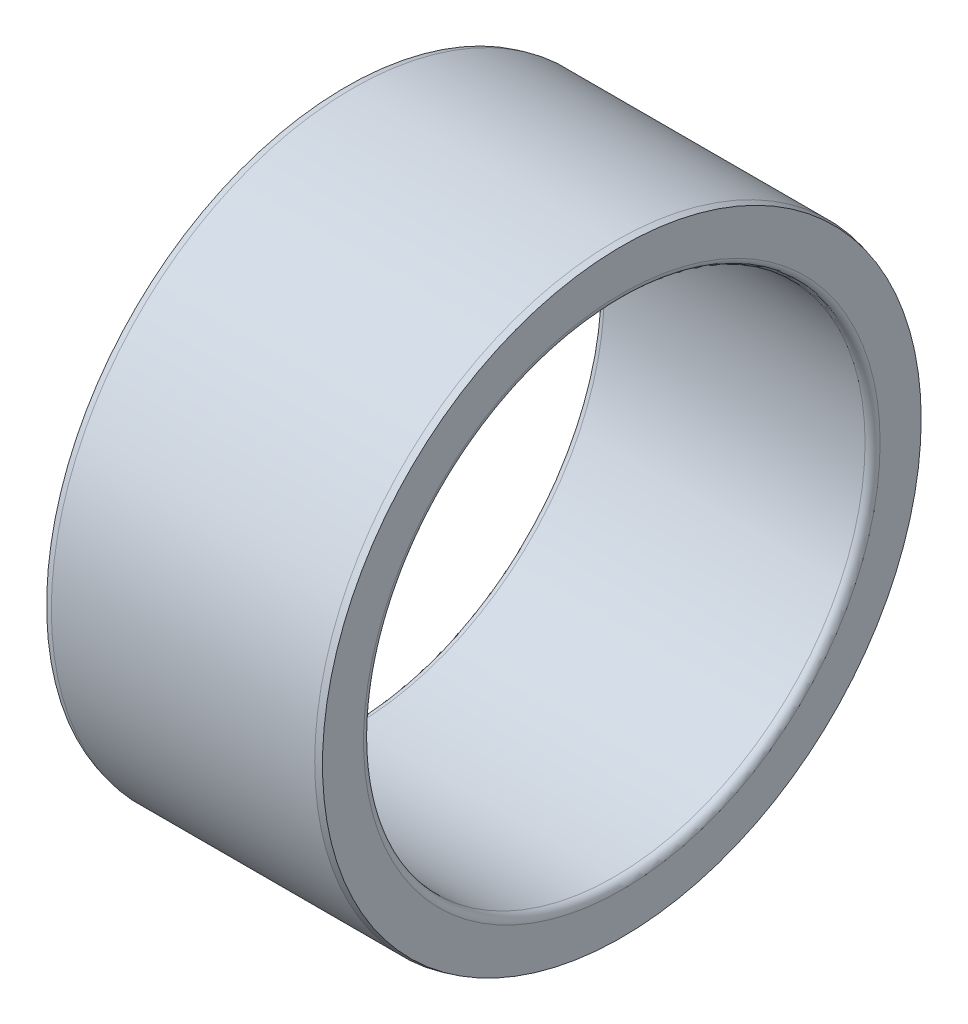
ISO-10303-21;
HEADER;
FILE_DESCRIPTION(('STEP AP214'),'2;1');
FILE_NAME('part.step','',(''),(''),'','','');
FILE_SCHEMA(('AUTOMOTIVE_DESIGN { 1 0 10303 214 1 1 1 1 }'));
ENDSEC;
DATA;
#1=APPLICATION_CONTEXT('core data for automotive mechanical design processes');
#2=APPLICATION_PROTOCOL_DEFINITION('international standard','automotive_design',2000,#1);
#3=PRODUCT_CONTEXT('',#1,'mechanical');
#4=PRODUCT('Part','Part','',(#3));
#5=PRODUCT_RELATED_PRODUCT_CATEGORY('part','',(#4));
#6=PRODUCT_DEFINITION_FORMATION('','',#4);
#7=PRODUCT_DEFINITION_CONTEXT('part definition',#1,'design');
#8=PRODUCT_DEFINITION('design','',#6,#7);
#9=PRODUCT_DEFINITION_SHAPE('','',#8);
#10=(LENGTH_UNIT() NAMED_UNIT(*) SI_UNIT(.MILLI.,.METRE.));
#11=(NAMED_UNIT(*) PLANE_ANGLE_UNIT() SI_UNIT($,.RADIAN.));
#12=(NAMED_UNIT(*) SI_UNIT($,.STERADIAN.) SOLID_ANGLE_UNIT());
#13=UNCERTAINTY_MEASURE_WITH_UNIT(LENGTH_MEASURE(1.E-05),#10,'distance_accuracy_value','');
#14=(GEOMETRIC_REPRESENTATION_CONTEXT(3) GLOBAL_UNCERTAINTY_ASSIGNED_CONTEXT((#13)) GLOBAL_UNIT_ASSIGNED_CONTEXT((#10,
#11,#12)) REPRESENTATION_CONTEXT('',''));
#15=CARTESIAN_POINT('',(0.,0.,0.));
#16=DIRECTION('',(0.,0.,1.));
#17=DIRECTION('',(1.,0.,0.));
#18=AXIS2_PLACEMENT_3D('',#15,#16,#17);
#19=CARTESIAN_POINT('',(0.,23.87625,0.));
#20=DIRECTION('',(-1.,0.,0.));
#21=DIRECTION('',(0.,0.,1.));
#22=AXIS2_PLACEMENT_3D('',#19,#20,#21);
#23=PLANE('',#22);
#24=CARTESIAN_POINT('',(0.,0.,0.));
#25=DIRECTION('',(1.,0.,0.));
#26=DIRECTION('',(0.,0.,-1.));
#27=AXIS2_PLACEMENT_3D('',#24,#25,#26);
#28=CIRCLE('',#27,20.6);
#29=CARTESIAN_POINT('',(0.,0.,-20.6));
#30=VERTEX_POINT('',#29);
#31=EDGE_CURVE('E44',#30,#30,#28,.T.);
#32=ORIENTED_EDGE('',*,*,#31,.T.);
#33=EDGE_LOOP('',(#32));
#34=FACE_BOUND('',#33,.T.);
#35=CARTESIAN_POINT('',(0.,0.,0.));
#36=DIRECTION('',(1.,0.,0.));
#37=DIRECTION('',(0.,0.,-1.));
#38=AXIS2_PLACEMENT_3D('',#35,#36,#37);
#39=CIRCLE('',#38,23.87625);
#40=CARTESIAN_POINT('',(0.,0.,-23.87625));
#41=VERTEX_POINT('',#40);
#42=EDGE_CURVE('E41',#41,#41,#39,.T.);
#43=ORIENTED_EDGE('',*,*,#42,.F.);
#44=EDGE_LOOP('',(#43));
#45=FACE_BOUND('',#44,.T.);
#46=ADVANCED_FACE('F15',(#34,#45),#23,.T.);
#47=CARTESIAN_POINT('',(0.599999999999874,0.,0.));
#48=DIRECTION('',(1.,0.,0.));
#49=DIRECTION('',(0.,0.,-1.));
#50=AXIS2_PLACEMENT_3D('',#47,#48,#49);
#51=TOROIDAL_SURFACE('',#50,20.6,0.599999999999874);
#52=CARTESIAN_POINT('',(0.6,0.,0.));
#53=DIRECTION('',(1.,0.,0.));
#54=DIRECTION('',(0.,0.,-1.));
#55=AXIS2_PLACEMENT_3D('',#52,#53,#54);
#56=CIRCLE('',#55,20.);
#57=CARTESIAN_POINT('',(0.6,0.,-20.));
#58=VERTEX_POINT('',#57);
#59=EDGE_CURVE('E38',#58,#58,#56,.T.);
#60=ORIENTED_EDGE('',*,*,#59,.T.);
#61=EDGE_LOOP('',(#60));
#62=FACE_BOUND('',#61,.T.);
#63=ORIENTED_EDGE('',*,*,#31,.F.);
#64=EDGE_LOOP('',(#63));
#65=FACE_BOUND('',#64,.T.);
#66=ADVANCED_FACE('F50',(#62,#65),#51,.T.);
#67=CARTESIAN_POINT('',(0.495,0.,0.));
#68=DIRECTION('',(1.,0.,0.));
#69=DIRECTION('',(0.,0.,-1.));
#70=AXIS2_PLACEMENT_3D('',#67,#68,#69);
#71=CONICAL_SURFACE('',#70,24.,0.244978663126868);
#72=ORIENTED_EDGE('',*,*,#42,.T.);
#73=EDGE_LOOP('',(#72));
#74=FACE_BOUND('',#73,.T.);
#75=CARTESIAN_POINT('',(0.495000000000001,0.,0.));
#76=DIRECTION('',(1.,0.,0.));
#77=DIRECTION('',(0.,0.,-1.));
#78=AXIS2_PLACEMENT_3D('',#75,#76,#77);
#79=CIRCLE('',#78,24.);
#80=CARTESIAN_POINT('',(0.495000000000001,0.,-24.));
#81=VERTEX_POINT('',#80);
#82=EDGE_CURVE('E35',#81,#81,#79,.T.);
#83=ORIENTED_EDGE('',*,*,#82,.F.);
#84=EDGE_LOOP('',(#83));
#85=FACE_BOUND('',#84,.T.);
#86=ADVANCED_FACE('F52',(#74,#85),#71,.T.);
#87=CARTESIAN_POINT('',(22.,0.,0.));
#88=DIRECTION('',(1.,0.,0.));
#89=DIRECTION('',(0.,0.,-1.));
#90=AXIS2_PLACEMENT_3D('',#87,#88,#89);
#91=CYLINDRICAL_SURFACE('',#90,20.);
#92=CARTESIAN_POINT('',(21.4,0.,0.));
#93=DIRECTION('',(1.,0.,0.));
#94=DIRECTION('',(0.,0.,-1.));
#95=AXIS2_PLACEMENT_3D('',#92,#93,#94);
#96=CIRCLE('',#95,20.);
#97=CARTESIAN_POINT('',(21.4,0.,-20.));
#98=VERTEX_POINT('',#97);
#99=EDGE_CURVE('E30',#98,#98,#96,.T.);
#100=ORIENTED_EDGE('',*,*,#99,.T.);
#101=EDGE_LOOP('',(#100));
#102=FACE_BOUND('',#101,.T.);
#103=ORIENTED_EDGE('',*,*,#59,.F.);
#104=EDGE_LOOP('',(#103));
#105=FACE_BOUND('',#104,.T.);
#106=ADVANCED_FACE('F60',(#102,#105),#91,.F.);
#107=CARTESIAN_POINT('',(22.,0.,0.));
#108=DIRECTION('',(1.,0.,0.));
#109=DIRECTION('',(0.,0.,-1.));
#110=AXIS2_PLACEMENT_3D('',#107,#108,#109);
#111=CYLINDRICAL_SURFACE('',#110,24.);
#112=ORIENTED_EDGE('',*,*,#82,.T.);
#113=EDGE_LOOP('',(#112));
#114=FACE_BOUND('',#113,.T.);
#115=CARTESIAN_POINT('',(21.505,0.,0.));
#116=DIRECTION('',(1.,0.,0.));
#117=DIRECTION('',(0.,0.,-1.));
#118=AXIS2_PLACEMENT_3D('',#115,#116,#117);
#119=CIRCLE('',#118,24.);
#120=CARTESIAN_POINT('',(21.505,0.,-24.));
#121=VERTEX_POINT('',#120);
#122=EDGE_CURVE('E26',#121,#121,#119,.T.);
#123=ORIENTED_EDGE('',*,*,#122,.F.);
#124=EDGE_LOOP('',(#123));
#125=FACE_BOUND('',#124,.T.);
#126=ADVANCED_FACE('F67',(#114,#125),#111,.T.);
#127=CARTESIAN_POINT('',(21.4000000000002,0.,0.));
#128=DIRECTION('',(1.,0.,0.));
#129=DIRECTION('',(0.,0.,-1.));
#130=AXIS2_PLACEMENT_3D('',#127,#128,#129);
#131=TOROIDAL_SURFACE('',#130,20.5999999999997,0.59999999999975);
#132=CARTESIAN_POINT('',(22.,0.,0.));
#133=DIRECTION('',(1.,0.,0.));
#134=DIRECTION('',(0.,0.,-1.));
#135=AXIS2_PLACEMENT_3D('',#132,#133,#134);
#136=CIRCLE('',#135,20.5999999999997);
#137=CARTESIAN_POINT('',(22.,0.,-20.5999999999997));
#138=VERTEX_POINT('',#137);
#139=EDGE_CURVE('E22',#138,#138,#136,.T.);
#140=ORIENTED_EDGE('',*,*,#139,.T.);
#141=EDGE_LOOP('',(#140));
#142=FACE_BOUND('',#141,.T.);
#143=ORIENTED_EDGE('',*,*,#99,.F.);
#144=EDGE_LOOP('',(#143));
#145=FACE_BOUND('',#144,.T.);
#146=ADVANCED_FACE('F71',(#142,#145),#131,.T.);
#147=CARTESIAN_POINT('',(22.,0.,0.));
#148=DIRECTION('',(-1.,0.,0.));
#149=DIRECTION('',(0.,0.,1.));
#150=AXIS2_PLACEMENT_3D('',#147,#148,#149);
#151=CONICAL_SURFACE('',#150,23.87625,0.244978663126868);
#152=ORIENTED_EDGE('',*,*,#122,.T.);
#153=EDGE_LOOP('',(#152));
#154=FACE_BOUND('',#153,.T.);
#155=CARTESIAN_POINT('',(22.,0.,0.));
#156=DIRECTION('',(1.,0.,0.));
#157=DIRECTION('',(0.,0.,-1.));
#158=AXIS2_PLACEMENT_3D('',#155,#156,#157);
#159=CIRCLE('',#158,23.87625);
#160=CARTESIAN_POINT('',(22.,0.,-23.87625));
#161=VERTEX_POINT('',#160);
#162=EDGE_CURVE('E10',#161,#161,#159,.T.);
#163=ORIENTED_EDGE('',*,*,#162,.F.);
#164=EDGE_LOOP('',(#163));
#165=FACE_BOUND('',#164,.T.);
#166=ADVANCED_FACE('F74',(#154,#165),#151,.T.);
#167=CARTESIAN_POINT('',(22.,20.6,0.));
#168=DIRECTION('',(1.,0.,0.));
#169=DIRECTION('',(0.,0.,-1.));
#170=AXIS2_PLACEMENT_3D('',#167,#168,#169);
#171=PLANE('',#170);
#172=ORIENTED_EDGE('',*,*,#162,.T.);
#173=EDGE_LOOP('',(#172));
#174=FACE_BOUND('',#173,.T.);
#175=ORIENTED_EDGE('',*,*,#139,.F.);
#176=EDGE_LOOP('',(#175));
#177=FACE_BOUND('',#176,.T.);
#178=ADVANCED_FACE('F17',(#174,#177),#171,.T.);
#179=CLOSED_SHELL('',(#46,#66,#86,#106,#126,#146,#166,#178));
#180=MANIFOLD_SOLID_BREP('B1',#179);
#181=ADVANCED_BREP_SHAPE_REPRESENTATION('',(#18,#180),#14);
#182=SHAPE_DEFINITION_REPRESENTATION(#9,#181);
ENDSEC;
END-ISO-10303-21;
